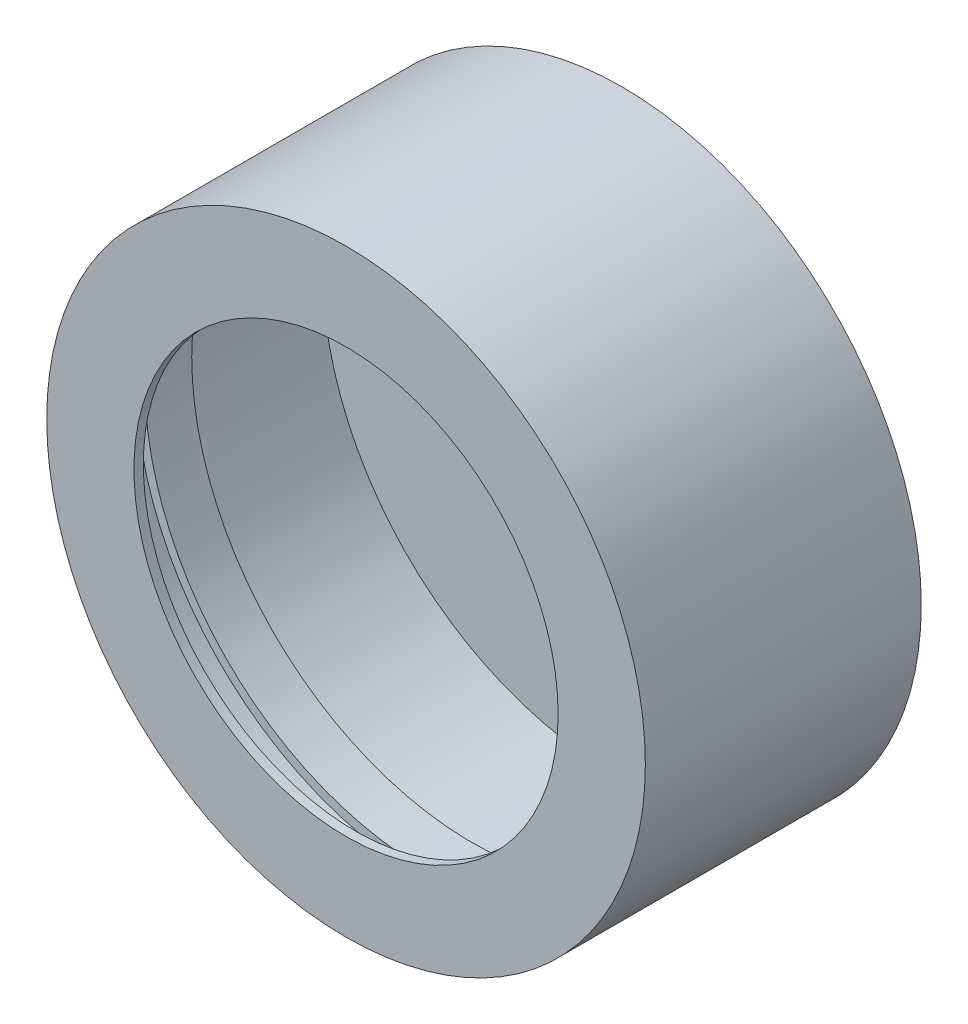
ISO-10303-21;
HEADER;
FILE_DESCRIPTION(('STEP AP214'),'2;1');
FILE_NAME('part.step','',(''),(''),'','','');
FILE_SCHEMA(('AUTOMOTIVE_DESIGN { 1 0 10303 214 1 1 1 1 }'));
ENDSEC;
DATA;
#1=APPLICATION_CONTEXT('core data for automotive mechanical design processes');
#2=APPLICATION_PROTOCOL_DEFINITION('international standard','automotive_design',2000,#1);
#3=PRODUCT_CONTEXT('',#1,'mechanical');
#4=PRODUCT('Part','Part','',(#3));
#5=PRODUCT_RELATED_PRODUCT_CATEGORY('part','',(#4));
#6=PRODUCT_DEFINITION_FORMATION('','',#4);
#7=PRODUCT_DEFINITION_CONTEXT('part definition',#1,'design');
#8=PRODUCT_DEFINITION('design','',#6,#7);
#9=PRODUCT_DEFINITION_SHAPE('','',#8);
#10=(LENGTH_UNIT() NAMED_UNIT(*) SI_UNIT(.MILLI.,.METRE.));
#11=(NAMED_UNIT(*) PLANE_ANGLE_UNIT() SI_UNIT($,.RADIAN.));
#12=(NAMED_UNIT(*) SI_UNIT($,.STERADIAN.) SOLID_ANGLE_UNIT());
#13=UNCERTAINTY_MEASURE_WITH_UNIT(LENGTH_MEASURE(1.E-05),#10,'distance_accuracy_value','');
#14=(GEOMETRIC_REPRESENTATION_CONTEXT(3) GLOBAL_UNCERTAINTY_ASSIGNED_CONTEXT((#13)) GLOBAL_UNIT_ASSIGNED_CONTEXT((#10,
#11,#12)) REPRESENTATION_CONTEXT('',''));
#15=CARTESIAN_POINT('',(0.,0.,0.));
#16=DIRECTION('',(0.,0.,1.));
#17=DIRECTION('',(1.,0.,0.));
#18=AXIS2_PLACEMENT_3D('',#15,#16,#17);
#19=CARTESIAN_POINT('',(0.,0.,-55.));
#20=DIRECTION('',(0.,0.,1.));
#21=DIRECTION('',(1.,0.,0.));
#22=AXIS2_PLACEMENT_3D('',#19,#20,#21);
#23=CYLINDRICAL_SURFACE('',#22,62.);
#24=CARTESIAN_POINT('',(0.,0.,0.));
#25=DIRECTION('',(0.,0.,1.));
#26=DIRECTION('',(1.,0.,0.));
#27=AXIS2_PLACEMENT_3D('',#24,#25,#26);
#28=CIRCLE('',#27,62.);
#29=CARTESIAN_POINT('',(62.,0.,0.));
#30=VERTEX_POINT('',#29);
#31=EDGE_CURVE('E51',#30,#30,#28,.T.);
#32=ORIENTED_EDGE('',*,*,#31,.T.);
#33=EDGE_LOOP('',(#32));
#34=FACE_BOUND('',#33,.T.);
#35=CARTESIAN_POINT('',(0.,0.,-15.));
#36=DIRECTION('',(0.,0.,-1.));
#37=DIRECTION('',(-1.,0.,0.));
#38=AXIS2_PLACEMENT_3D('',#35,#36,#37);
#39=CIRCLE('',#38,62.);
#40=CARTESIAN_POINT('',(-62.,0.,-15.));
#41=VERTEX_POINT('',#40);
#42=EDGE_CURVE('E10',#41,#41,#39,.F.);
#43=ORIENTED_EDGE('',*,*,#42,.F.);
#44=EDGE_LOOP('',(#43));
#45=FACE_BOUND('',#44,.T.);
#46=ADVANCED_FACE('F32',(#34,#45),#23,.F.);
#47=CARTESIAN_POINT('',(0.,0.,-55.));
#48=DIRECTION('',(0.,0.,1.));
#49=DIRECTION('',(1.,0.,0.));
#50=AXIS2_PLACEMENT_3D('',#47,#48,#49);
#51=CYLINDRICAL_SURFACE('',#50,64.);
#52=CARTESIAN_POINT('',(0.,0.,2.));
#53=DIRECTION('',(0.,0.,1.));
#54=DIRECTION('',(1.,0.,0.));
#55=AXIS2_PLACEMENT_3D('',#52,#53,#54);
#56=CIRCLE('',#55,64.);
#57=CARTESIAN_POINT('',(64.,0.,2.));
#58=VERTEX_POINT('',#57);
#59=EDGE_CURVE('E54',#58,#58,#56,.T.);
#60=ORIENTED_EDGE('',*,*,#59,.F.);
#61=EDGE_LOOP('',(#60));
#62=FACE_BOUND('',#61,.T.);
#63=CARTESIAN_POINT('',(0.,0.,-57.));
#64=DIRECTION('',(0.,0.,-1.));
#65=DIRECTION('',(-1.,0.,0.));
#66=AXIS2_PLACEMENT_3D('',#63,#64,#65);
#67=CIRCLE('',#66,64.);
#68=CARTESIAN_POINT('',(-64.,0.,-57.));
#69=VERTEX_POINT('',#68);
#70=EDGE_CURVE('E98',#69,#69,#67,.T.);
#71=ORIENTED_EDGE('',*,*,#70,.F.);
#72=EDGE_LOOP('',(#71));
#73=FACE_BOUND('',#72,.T.);
#74=ADVANCED_FACE('F34',(#62,#73),#51,.T.);
#75=CARTESIAN_POINT('',(0.,0.,-25.));
#76=DIRECTION('',(0.,0.,-1.));
#77=DIRECTION('',(-1.,0.,0.));
#78=AXIS2_PLACEMENT_3D('',#75,#76,#77);
#79=CIRCLE('',#78,62.);
#80=CARTESIAN_POINT('',(-62.,0.,-25.));
#81=VERTEX_POINT('',#80);
#82=EDGE_CURVE('E43',#81,#81,#79,.T.);
#83=ORIENTED_EDGE('',*,*,#82,.F.);
#84=EDGE_LOOP('',(#83));
#85=FACE_BOUND('',#84,.T.);
#86=CARTESIAN_POINT('',(0.,0.,-55.));
#87=DIRECTION('',(0.,0.,1.));
#88=DIRECTION('',(1.,0.,0.));
#89=AXIS2_PLACEMENT_3D('',#86,#87,#88);
#90=CIRCLE('',#89,62.);
#91=CARTESIAN_POINT('',(62.,0.,-55.));
#92=VERTEX_POINT('',#91);
#93=EDGE_CURVE('E39',#92,#92,#90,.T.);
#94=ORIENTED_EDGE('',*,*,#93,.F.);
#95=EDGE_LOOP('',(#94));
#96=FACE_BOUND('',#95,.T.);
#97=ADVANCED_FACE('F77',(#85,#96),#23,.F.);
#98=CARTESIAN_POINT('',(0.,0.,-25.));
#99=DIRECTION('',(0.,0.,-1.));
#100=DIRECTION('',(-1.,0.,0.));
#101=AXIS2_PLACEMENT_3D('',#98,#99,#100);
#102=PLANE('',#101);
#103=ORIENTED_EDGE('',*,*,#82,.T.);
#104=EDGE_LOOP('',(#103));
#105=FACE_BOUND('',#104,.T.);
#106=CARTESIAN_POINT('',(0.,0.,-25.));
#107=DIRECTION('',(0.,0.,-1.));
#108=DIRECTION('',(-1.,0.,0.));
#109=AXIS2_PLACEMENT_3D('',#106,#107,#108);
#110=CIRCLE('',#109,60.);
#111=CARTESIAN_POINT('',(-60.,0.,-25.));
#112=VERTEX_POINT('',#111);
#113=EDGE_CURVE('E48',#112,#112,#110,.T.);
#114=ORIENTED_EDGE('',*,*,#113,.F.);
#115=EDGE_LOOP('',(#114));
#116=FACE_BOUND('',#115,.T.);
#117=ADVANCED_FACE('F74',(#105,#116),#102,.T.);
#118=CARTESIAN_POINT('',(0.,0.,-15.));
#119=DIRECTION('',(0.,0.,-1.));
#120=DIRECTION('',(-1.,0.,0.));
#121=AXIS2_PLACEMENT_3D('',#118,#119,#120);
#122=PLANE('',#121);
#123=ORIENTED_EDGE('',*,*,#42,.T.);
#124=EDGE_LOOP('',(#123));
#125=FACE_BOUND('',#124,.T.);
#126=CARTESIAN_POINT('',(0.,0.,-15.));
#127=DIRECTION('',(0.,0.,-1.));
#128=DIRECTION('',(-1.,0.,0.));
#129=AXIS2_PLACEMENT_3D('',#126,#127,#128);
#130=CIRCLE('',#129,60.);
#131=CARTESIAN_POINT('',(-60.,0.,-15.));
#132=VERTEX_POINT('',#131);
#133=EDGE_CURVE('E53',#132,#132,#130,.T.);
#134=ORIENTED_EDGE('',*,*,#133,.T.);
#135=EDGE_LOOP('',(#134));
#136=FACE_BOUND('',#135,.T.);
#137=ADVANCED_FACE('F76',(#125,#136),#122,.F.);
#138=CARTESIAN_POINT('',(0.,0.,-25.));
#139=DIRECTION('',(0.,0.,1.));
#140=DIRECTION('',(1.,0.,0.));
#141=AXIS2_PLACEMENT_3D('',#138,#139,#140);
#142=CYLINDRICAL_SURFACE('',#141,60.);
#143=ORIENTED_EDGE('',*,*,#113,.T.);
#144=EDGE_LOOP('',(#143));
#145=FACE_BOUND('',#144,.T.);
#146=ORIENTED_EDGE('',*,*,#133,.F.);
#147=EDGE_LOOP('',(#146));
#148=FACE_BOUND('',#147,.T.);
#149=ADVANCED_FACE('F71',(#145,#148),#142,.F.);
#150=CARTESIAN_POINT('',(0.,0.,0.));
#151=DIRECTION('',(0.,0.,1.));
#152=DIRECTION('',(1.,0.,0.));
#153=AXIS2_PLACEMENT_3D('',#150,#151,#152);
#154=PLANE('',#153);
#155=CARTESIAN_POINT('',(8.46482342130386E-13,8.0491715032473E-13,0.));
#156=DIRECTION('',(0.,0.,1.));
#157=DIRECTION('',(1.,0.,0.));
#158=AXIS2_PLACEMENT_3D('',#155,#156,#157);
#159=CIRCLE('',#158,45.35);
#160=CARTESIAN_POINT('',(45.3500000000008,8.0491715032473E-13,0.));
#161=VERTEX_POINT('',#160);
#162=EDGE_CURVE('E64',#161,#161,#159,.T.);
#163=ORIENTED_EDGE('',*,*,#162,.T.);
#164=EDGE_LOOP('',(#163));
#165=FACE_BOUND('',#164,.T.);
#166=ORIENTED_EDGE('',*,*,#31,.F.);
#167=EDGE_LOOP('',(#166));
#168=FACE_BOUND('',#167,.T.);
#169=ADVANCED_FACE('F131',(#165,#168),#154,.F.);
#170=CARTESIAN_POINT('',(0.,0.,2.));
#171=DIRECTION('',(0.,0.,1.));
#172=DIRECTION('',(1.,0.,0.));
#173=AXIS2_PLACEMENT_3D('',#170,#171,#172);
#174=PLANE('',#173);
#175=ORIENTED_EDGE('',*,*,#59,.T.);
#176=EDGE_LOOP('',(#175));
#177=FACE_BOUND('',#176,.T.);
#178=CARTESIAN_POINT('',(8.46482342130386E-13,8.0491715032473E-13,2.));
#179=DIRECTION('',(0.,0.,1.));
#180=DIRECTION('',(1.,0.,0.));
#181=AXIS2_PLACEMENT_3D('',#178,#179,#180);
#182=CIRCLE('',#181,45.35);
#183=CARTESIAN_POINT('',(45.3500000000008,8.0491715032473E-13,2.));
#184=VERTEX_POINT('',#183);
#185=EDGE_CURVE('E59',#184,#184,#182,.T.);
#186=ORIENTED_EDGE('',*,*,#185,.F.);
#187=EDGE_LOOP('',(#186));
#188=FACE_BOUND('',#187,.T.);
#189=ADVANCED_FACE('F127',(#177,#188),#174,.T.);
#190=CARTESIAN_POINT('',(8.46482342130386E-13,8.0491715032473E-13,2.));
#191=DIRECTION('',(0.,0.,-1.));
#192=DIRECTION('',(-1.,0.,0.));
#193=AXIS2_PLACEMENT_3D('',#190,#191,#192);
#194=CYLINDRICAL_SURFACE('',#193,45.35);
#195=ORIENTED_EDGE('',*,*,#185,.T.);
#196=EDGE_LOOP('',(#195));
#197=FACE_BOUND('',#196,.T.);
#198=ORIENTED_EDGE('',*,*,#162,.F.);
#199=EDGE_LOOP('',(#198));
#200=FACE_BOUND('',#199,.T.);
#201=ADVANCED_FACE('F124',(#197,#200),#194,.F.);
#202=CARTESIAN_POINT('',(0.,0.,-55.));
#203=DIRECTION('',(0.,0.,-1.));
#204=DIRECTION('',(-1.,0.,0.));
#205=AXIS2_PLACEMENT_3D('',#202,#203,#204);
#206=PLANE('',#205);
#207=CARTESIAN_POINT('',(8.46069950922521E-13,7.91128320636996E-13,-55.));
#208=DIRECTION('',(0.,0.,-1.));
#209=DIRECTION('',(-1.,0.,0.));
#210=AXIS2_PLACEMENT_3D('',#207,#208,#209);
#211=CIRCLE('',#210,29.);
#212=CARTESIAN_POINT('',(-28.9999999999992,7.91128320636996E-13,-55.));
#213=VERTEX_POINT('',#212);
#214=EDGE_CURVE('E104',#213,#213,#211,.T.);
#215=ORIENTED_EDGE('',*,*,#214,.T.);
#216=EDGE_LOOP('',(#215));
#217=FACE_BOUND('',#216,.T.);
#218=ORIENTED_EDGE('',*,*,#93,.T.);
#219=EDGE_LOOP('',(#218));
#220=FACE_BOUND('',#219,.T.);
#221=ADVANCED_FACE('F110',(#217,#220),#206,.F.);
#222=CARTESIAN_POINT('',(0.,0.,-57.));
#223=DIRECTION('',(0.,0.,-1.));
#224=DIRECTION('',(-1.,0.,0.));
#225=AXIS2_PLACEMENT_3D('',#222,#223,#224);
#226=PLANE('',#225);
#227=ORIENTED_EDGE('',*,*,#70,.T.);
#228=EDGE_LOOP('',(#227));
#229=FACE_BOUND('',#228,.T.);
#230=CARTESIAN_POINT('',(8.46069950922521E-13,7.91128320636996E-13,-57.));
#231=DIRECTION('',(0.,0.,-1.));
#232=DIRECTION('',(-1.,0.,0.));
#233=AXIS2_PLACEMENT_3D('',#230,#231,#232);
#234=CIRCLE('',#233,29.);
#235=CARTESIAN_POINT('',(-28.9999999999992,7.91128320636996E-13,-57.));
#236=VERTEX_POINT('',#235);
#237=EDGE_CURVE('E100',#236,#236,#234,.T.);
#238=ORIENTED_EDGE('',*,*,#237,.F.);
#239=EDGE_LOOP('',(#238));
#240=FACE_BOUND('',#239,.T.);
#241=ADVANCED_FACE('F114',(#229,#240),#226,.T.);
#242=CARTESIAN_POINT('',(8.46069950922521E-13,7.91128320636996E-13,-57.));
#243=DIRECTION('',(0.,0.,1.));
#244=DIRECTION('',(1.,0.,0.));
#245=AXIS2_PLACEMENT_3D('',#242,#243,#244);
#246=CYLINDRICAL_SURFACE('',#245,29.);
#247=ORIENTED_EDGE('',*,*,#237,.T.);
#248=EDGE_LOOP('',(#247));
#249=FACE_BOUND('',#248,.T.);
#250=ORIENTED_EDGE('',*,*,#214,.F.);
#251=EDGE_LOOP('',(#250));
#252=FACE_BOUND('',#251,.T.);
#253=ADVANCED_FACE('F112',(#249,#252),#246,.F.);
#254=CLOSED_SHELL('',(#46,#74,#97,#117,#137,#149,#169,#189,#201,#221,#241,#253));
#255=MANIFOLD_SOLID_BREP('B2',#254);
#256=ADVANCED_BREP_SHAPE_REPRESENTATION('',(#18,#255),#14);
#257=SHAPE_DEFINITION_REPRESENTATION(#9,#256);
ENDSEC;
END-ISO-10303-21;
